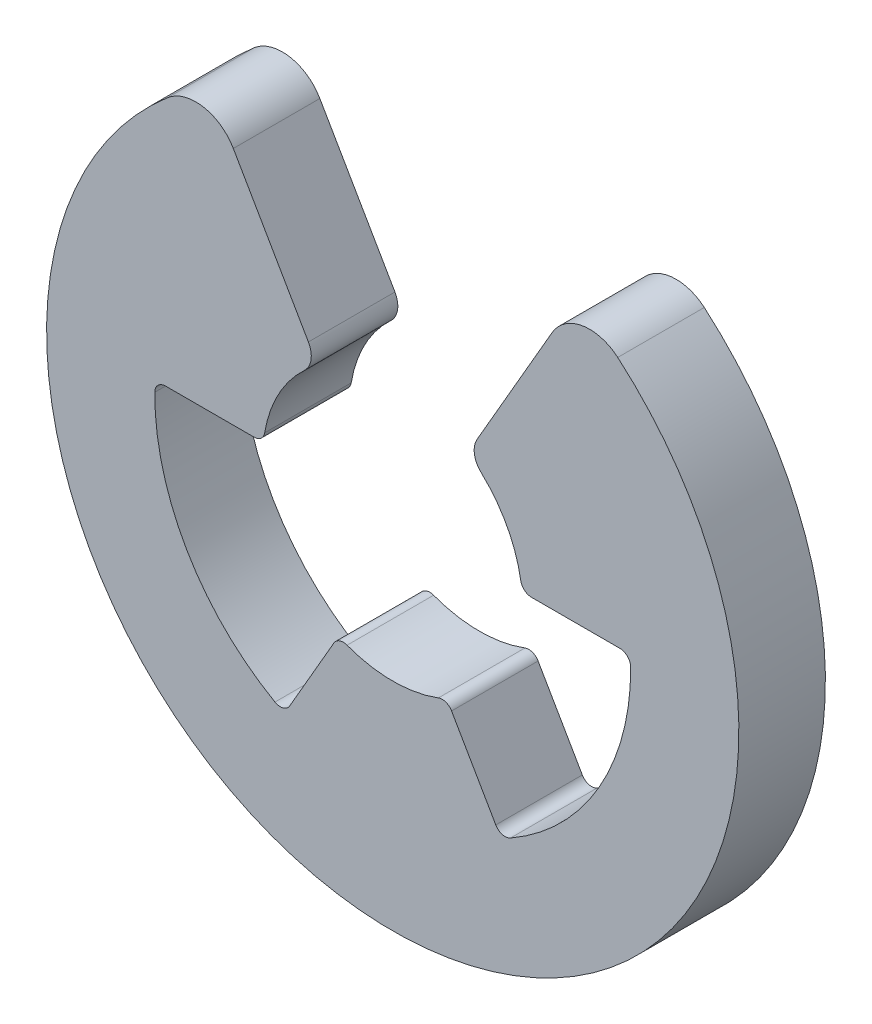
ISO-10303-21;
HEADER;
FILE_DESCRIPTION(('STEP AP214'),'2;1');
FILE_NAME('part.step','',(''),(''),'','','');
FILE_SCHEMA(('AUTOMOTIVE_DESIGN { 1 0 10303 214 1 1 1 1 }'));
ENDSEC;
DATA;
#1=APPLICATION_CONTEXT('core data for automotive mechanical design processes');
#2=APPLICATION_PROTOCOL_DEFINITION('international standard','automotive_design',2000,#1);
#3=PRODUCT_CONTEXT('',#1,'mechanical');
#4=PRODUCT('Part','Part','',(#3));
#5=PRODUCT_RELATED_PRODUCT_CATEGORY('part','',(#4));
#6=PRODUCT_DEFINITION_FORMATION('','',#4);
#7=PRODUCT_DEFINITION_CONTEXT('part definition',#1,'design');
#8=PRODUCT_DEFINITION('design','',#6,#7);
#9=PRODUCT_DEFINITION_SHAPE('','',#8);
#10=(LENGTH_UNIT() NAMED_UNIT(*) SI_UNIT(.MILLI.,.METRE.));
#11=(NAMED_UNIT(*) PLANE_ANGLE_UNIT() SI_UNIT($,.RADIAN.));
#12=(NAMED_UNIT(*) SI_UNIT($,.STERADIAN.) SOLID_ANGLE_UNIT());
#13=UNCERTAINTY_MEASURE_WITH_UNIT(LENGTH_MEASURE(1.E-05),#10,'distance_accuracy_value','');
#14=(GEOMETRIC_REPRESENTATION_CONTEXT(3) GLOBAL_UNCERTAINTY_ASSIGNED_CONTEXT((#13)) GLOBAL_UNIT_ASSIGNED_CONTEXT((#10,
#11,#12)) REPRESENTATION_CONTEXT('',''));
#15=CARTESIAN_POINT('',(0.,0.,0.));
#16=DIRECTION('',(0.,0.,1.));
#17=DIRECTION('',(1.,0.,0.));
#18=AXIS2_PLACEMENT_3D('',#15,#16,#17);
#19=CARTESIAN_POINT('',(5.24990813697038,0.0310572595990377,1.99999999999972));
#20=DIRECTION('',(0.,0.,-1.));
#21=DIRECTION('',(-0.999999999999996,0.,0.));
#22=AXIS2_PLACEMENT_3D('',#19,#20,#21);
#23=CYLINDRICAL_SURFACE('',#22,0.250000000000024);
#24=CARTESIAN_POINT('',(5.24990813697043,0.0310572595989822,-2.77555756156289E-13));
#25=DIRECTION('',(0.,0.,-1.));
#26=DIRECTION('',(0.999999999999996,0.,0.));
#27=AXIS2_PLACEMENT_3D('',#24,#25,#26);
#28=CIRCLE('',#27,0.250000000000024);
#29=CARTESIAN_POINT('',(5.24990813697015,0.281057259598816,-2.77555756156289E-13));
#30=VERTEX_POINT('',#29);
#31=CARTESIAN_POINT('',(5.49990376254042,0.0325361767225529,-2.77555756156289E-13));
#32=VERTEX_POINT('',#31);
#33=EDGE_CURVE('E256',#30,#32,#28,.T.);
#34=ORIENTED_EDGE('',*,*,#33,.T.);
#35=DIRECTION('',(0.,0.,-1.));
#36=VECTOR('',#35,1.);
#37=CARTESIAN_POINT('',(5.49990376254017,0.032536176722775,1.99999999999972));
#38=LINE('',#37,#36);
#39=CARTESIAN_POINT('',(5.49990376254017,0.032536176722775,1.99999999999972));
#40=VERTEX_POINT('',#39);
#41=EDGE_CURVE('E13',#40,#32,#38,.T.);
#42=ORIENTED_EDGE('',*,*,#41,.F.);
#43=CARTESIAN_POINT('',(5.24990813697038,0.0310572595990377,1.99999999999972));
#44=DIRECTION('',(0.,0.,-1.));
#45=DIRECTION('',(0.999999999999996,0.,0.));
#46=AXIS2_PLACEMENT_3D('',#43,#44,#45);
#47=CIRCLE('',#46,0.250000000000024);
#48=CARTESIAN_POINT('',(5.24990813697021,0.281057259598788,1.99999999999972));
#49=VERTEX_POINT('',#48);
#50=EDGE_CURVE('E328',#49,#40,#47,.T.);
#51=ORIENTED_EDGE('',*,*,#50,.F.);
#52=DIRECTION('',(0.,0.,-1.));
#53=VECTOR('',#52,1.);
#54=CARTESIAN_POINT('',(5.24990813697021,0.281057259598788,1.99999999999972));
#55=LINE('',#54,#53);
#56=EDGE_CURVE('E252',#49,#30,#55,.T.);
#57=ORIENTED_EDGE('',*,*,#56,.T.);
#58=EDGE_LOOP('',(#34,#42,#51,#57));
#59=FACE_BOUND('',#58,.T.);
#60=ADVANCED_FACE('F58',(#59),#23,.F.);
#61=CARTESIAN_POINT('',(0.,0.,2.));
#62=DIRECTION('',(0.,0.,-1.));
#63=DIRECTION('',(-0.999999999999996,0.,0.));
#64=AXIS2_PLACEMENT_3D('',#61,#62,#63);
#65=CYLINDRICAL_SURFACE('',#64,5.5);
#66=CARTESIAN_POINT('',(0.,0.,0.));
#67=DIRECTION('',(0.,0.,-1.));
#68=DIRECTION('',(0.999999999999996,0.,0.));
#69=AXIS2_PLACEMENT_3D('',#66,#67,#68);
#70=CIRCLE('',#69,5.5);
#71=CARTESIAN_POINT('',(2.72177472568619,-4.77932446509083,0.));
#72=VERTEX_POINT('',#71);
#73=EDGE_CURVE('E260',#32,#72,#70,.T.);
#74=ORIENTED_EDGE('',*,*,#73,.T.);
#75=DIRECTION('',(0.,0.,-1.));
#76=VECTOR('',#75,1.);
#77=CARTESIAN_POINT('',(2.72177472568624,-4.77932446509077,2.00000000000006));
#78=LINE('',#77,#76);
#79=CARTESIAN_POINT('',(2.72177472568624,-4.77932446509077,2.00000000000006));
#80=VERTEX_POINT('',#79);
#81=EDGE_CURVE('E67',#80,#72,#78,.T.);
#82=ORIENTED_EDGE('',*,*,#81,.F.);
#83=CARTESIAN_POINT('',(0.,0.,2.));
#84=DIRECTION('',(0.,0.,-1.));
#85=DIRECTION('',(0.999999999999996,0.,0.));
#86=AXIS2_PLACEMENT_3D('',#83,#84,#85);
#87=CIRCLE('',#86,5.5);
#88=EDGE_CURVE('E166',#40,#80,#87,.T.);
#89=ORIENTED_EDGE('',*,*,#88,.F.);
#90=ORIENTED_EDGE('',*,*,#41,.T.);
#91=EDGE_LOOP('',(#74,#82,#89,#90));
#92=FACE_BOUND('',#91,.T.);
#93=ADVANCED_FACE('F524',(#92),#65,.F.);
#94=CARTESIAN_POINT('',(2.59805769270058,-4.56208244395034,1.99999999999995));
#95=DIRECTION('',(0.,0.,-1.));
#96=DIRECTION('',(-0.999999999999996,0.,0.));
#97=AXIS2_PLACEMENT_3D('',#94,#95,#96);
#98=CYLINDRICAL_SURFACE('',#97,0.25);
#99=CARTESIAN_POINT('',(2.59805769270077,-4.56208244395037,0.));
#100=DIRECTION('',(0.,0.,-1.));
#101=DIRECTION('',(-0.999999999999996,0.,0.));
#102=AXIS2_PLACEMENT_3D('',#99,#100,#101);
#103=CIRCLE('',#102,0.25);
#104=CARTESIAN_POINT('',(2.38155134175455,-4.68708244395041,0.));
#105=VERTEX_POINT('',#104);
#106=EDGE_CURVE('E263',#72,#105,#103,.T.);
#107=ORIENTED_EDGE('',*,*,#106,.T.);
#108=DIRECTION('',(0.,0.,-1.));
#109=VECTOR('',#108,1.);
#110=CARTESIAN_POINT('',(2.38155134175444,-4.68708244395033,1.99999999999995));
#111=LINE('',#110,#109);
#112=CARTESIAN_POINT('',(2.38155134175444,-4.68708244395033,1.99999999999995));
#113=VERTEX_POINT('',#112);
#114=EDGE_CURVE('E403',#113,#105,#111,.T.);
#115=ORIENTED_EDGE('',*,*,#114,.F.);
#116=CARTESIAN_POINT('',(2.59805769270058,-4.56208244395034,1.99999999999995));
#117=DIRECTION('',(0.,0.,-1.));
#118=DIRECTION('',(-0.999999999999996,0.,0.));
#119=AXIS2_PLACEMENT_3D('',#116,#117,#118);
#120=CIRCLE('',#119,0.25);
#121=EDGE_CURVE('E414',#80,#113,#120,.T.);
#122=ORIENTED_EDGE('',*,*,#121,.F.);
#123=ORIENTED_EDGE('',*,*,#81,.T.);
#124=EDGE_LOOP('',(#107,#115,#122,#123));
#125=FACE_BOUND('',#124,.T.);
#126=ADVANCED_FACE('F412',(#125),#98,.F.);
#127=CARTESIAN_POINT('',(2.38155134175444,-4.68708244395033,1.99999999999995));
#128=DIRECTION('',(-0.86602540378444,-0.499999999999998,0.));
#129=DIRECTION('',(0.499999999999991,-0.866025403784441,0.));
#130=AXIS2_PLACEMENT_3D('',#127,#128,#129);
#131=PLANE('',#130);
#132=DIRECTION('',(-0.499999999999991,0.866025403784441,0.));
#133=VECTOR('',#132,1.);
#134=CARTESIAN_POINT('',(2.38155134175455,-4.68708244395041,0.));
#135=LINE('',#134,#133);
#136=CARTESIAN_POINT('',(1.35975651263315,-2.91728188500065,1.66533453693773E-13));
#137=VERTEX_POINT('',#136);
#138=EDGE_CURVE('E266',#105,#137,#135,.T.);
#139=ORIENTED_EDGE('',*,*,#138,.T.);
#140=DIRECTION('',(0.,0.,-1.));
#141=VECTOR('',#140,1.);
#142=CARTESIAN_POINT('',(1.35975651263295,-2.91728188500068,2.00000000000017));
#143=LINE('',#142,#141);
#144=CARTESIAN_POINT('',(1.35975651263295,-2.91728188500068,2.00000000000017));
#145=VERTEX_POINT('',#144);
#146=EDGE_CURVE('E399',#145,#137,#143,.T.);
#147=ORIENTED_EDGE('',*,*,#146,.F.);
#148=DIRECTION('',(-0.499999999999991,0.866025403784441,0.));
#149=VECTOR('',#148,1.);
#150=CARTESIAN_POINT('',(2.38155134175444,-4.68708244395033,1.99999999999995));
#151=LINE('',#150,#149);
#152=EDGE_CURVE('E433',#113,#145,#151,.T.);
#153=ORIENTED_EDGE('',*,*,#152,.F.);
#154=ORIENTED_EDGE('',*,*,#114,.T.);
#155=EDGE_LOOP('',(#139,#147,#153,#154));
#156=FACE_BOUND('',#155,.T.);
#157=ADVANCED_FACE('F423',(#156),#131,.F.);
#158=CARTESIAN_POINT('',(1.14325016168668,-3.04228188500069,2.00000000000017));
#159=DIRECTION('',(0.,0.,-1.));
#160=DIRECTION('',(-0.999999999999996,0.,0.));
#161=AXIS2_PLACEMENT_3D('',#158,#159,#160);
#162=CYLINDRICAL_SURFACE('',#161,0.25);
#163=CARTESIAN_POINT('',(1.14325016168704,-3.04228188500072,1.66533453693773E-13));
#164=DIRECTION('',(0.,0.,1.));
#165=DIRECTION('',(0.999999999999996,0.,0.));
#166=AXIS2_PLACEMENT_3D('',#163,#164,#165);
#167=CIRCLE('',#166,0.25);
#168=CARTESIAN_POINT('',(1.05530784155727,-2.80826020153915,1.66533453693773E-13));
#169=VERTEX_POINT('',#168);
#170=EDGE_CURVE('E269',#137,#169,#167,.T.);
#171=ORIENTED_EDGE('',*,*,#170,.T.);
#172=DIRECTION('',(0.,0.,-1.));
#173=VECTOR('',#172,1.);
#174=CARTESIAN_POINT('',(1.05530784155702,-2.80826020153896,2.00000000000017));
#175=LINE('',#174,#173);
#176=CARTESIAN_POINT('',(1.05530784155702,-2.80826020153896,2.00000000000017));
#177=VERTEX_POINT('',#176);
#178=EDGE_CURVE('E395',#177,#169,#175,.T.);
#179=ORIENTED_EDGE('',*,*,#178,.F.);
#180=CARTESIAN_POINT('',(1.14325016168668,-3.04228188500069,2.00000000000017));
#181=DIRECTION('',(0.,0.,1.));
#182=DIRECTION('',(0.999999999999996,0.,0.));
#183=AXIS2_PLACEMENT_3D('',#180,#181,#182);
#184=CIRCLE('',#183,0.25);
#185=EDGE_CURVE('E429',#145,#177,#184,.T.);
#186=ORIENTED_EDGE('',*,*,#185,.F.);
#187=ORIENTED_EDGE('',*,*,#146,.T.);
#188=EDGE_LOOP('',(#171,#179,#186,#187));
#189=FACE_BOUND('',#188,.T.);
#190=ADVANCED_FACE('F427',(#189),#162,.T.);
#191=CARTESIAN_POINT('',(0.,0.,2.));
#192=DIRECTION('',(0.,0.,-1.));
#193=DIRECTION('',(-0.999999999999996,0.,0.));
#194=AXIS2_PLACEMENT_3D('',#191,#192,#193);
#195=CYLINDRICAL_SURFACE('',#194,3.);
#196=CARTESIAN_POINT('',(0.,0.,0.));
#197=DIRECTION('',(0.,0.,-1.));
#198=DIRECTION('',(0.999999999999996,0.,0.));
#199=AXIS2_PLACEMENT_3D('',#196,#197,#198);
#200=CIRCLE('',#199,3.);
#201=CARTESIAN_POINT('',(-1.05530784155694,-2.80826020153918,0.));
#202=VERTEX_POINT('',#201);
#203=EDGE_CURVE('E272',#169,#202,#200,.T.);
#204=ORIENTED_EDGE('',*,*,#203,.T.);
#205=DIRECTION('',(0.,0.,-1.));
#206=VECTOR('',#205,1.);
#207=CARTESIAN_POINT('',(-1.05530784155697,-2.80826020153901,2.00000000000006));
#208=LINE('',#207,#206);
#209=CARTESIAN_POINT('',(-1.05530784155697,-2.80826020153901,2.00000000000006));
#210=VERTEX_POINT('',#209);
#211=EDGE_CURVE('E391',#210,#202,#208,.T.);
#212=ORIENTED_EDGE('',*,*,#211,.F.);
#213=CARTESIAN_POINT('',(0.,0.,2.));
#214=DIRECTION('',(0.,0.,-1.));
#215=DIRECTION('',(0.999999999999996,0.,0.));
#216=AXIS2_PLACEMENT_3D('',#213,#214,#215);
#217=CIRCLE('',#216,3.);
#218=EDGE_CURVE('E432',#177,#210,#217,.T.);
#219=ORIENTED_EDGE('',*,*,#218,.F.);
#220=ORIENTED_EDGE('',*,*,#178,.T.);
#221=EDGE_LOOP('',(#204,#212,#219,#220));
#222=FACE_BOUND('',#221,.T.);
#223=ADVANCED_FACE('F537',(#222),#195,.F.);
#224=CARTESIAN_POINT('',(-1.14325016168684,-3.04228188500089,2.00000000000006));
#225=DIRECTION('',(0.,0.,-1.));
#226=DIRECTION('',(-0.999999999999996,0.,0.));
#227=AXIS2_PLACEMENT_3D('',#224,#225,#226);
#228=CYLINDRICAL_SURFACE('',#227,0.25);
#229=CARTESIAN_POINT('',(-1.14325016168659,-3.04228188500083,0.));
#230=DIRECTION('',(0.,0.,1.));
#231=DIRECTION('',(-0.999999999999996,0.,0.));
#232=AXIS2_PLACEMENT_3D('',#229,#230,#231);
#233=CIRCLE('',#232,0.25);
#234=CARTESIAN_POINT('',(-1.35975651263265,-2.91728188500065,0.));
#235=VERTEX_POINT('',#234);
#236=EDGE_CURVE('E275',#202,#235,#233,.T.);
#237=ORIENTED_EDGE('',*,*,#236,.T.);
#238=DIRECTION('',(0.,0.,-1.));
#239=VECTOR('',#238,1.);
#240=CARTESIAN_POINT('',(-1.35975651263284,-2.91728188500068,2.00000000000006));
#241=LINE('',#240,#239);
#242=CARTESIAN_POINT('',(-1.35975651263284,-2.91728188500068,2.00000000000006));
#243=VERTEX_POINT('',#242);
#244=EDGE_CURVE('E387',#243,#235,#241,.T.);
#245=ORIENTED_EDGE('',*,*,#244,.F.);
#246=CARTESIAN_POINT('',(-1.14325016168684,-3.04228188500089,2.00000000000006));
#247=DIRECTION('',(0.,0.,1.));
#248=DIRECTION('',(-0.999999999999996,0.,0.));
#249=AXIS2_PLACEMENT_3D('',#246,#247,#248);
#250=CIRCLE('',#249,0.25);
#251=EDGE_CURVE('E438',#210,#243,#250,.T.);
#252=ORIENTED_EDGE('',*,*,#251,.F.);
#253=ORIENTED_EDGE('',*,*,#211,.T.);
#254=EDGE_LOOP('',(#237,#245,#252,#253));
#255=FACE_BOUND('',#254,.T.);
#256=ADVANCED_FACE('F540',(#255),#228,.T.);
#257=CARTESIAN_POINT('',(-2.38155134175434,-4.68708244395044,1.99999999999984));
#258=DIRECTION('',(0.866025403784437,-0.499999999999993,0.));
#259=DIRECTION('',(0.499999999999996,0.866025403784444,0.));
#260=AXIS2_PLACEMENT_3D('',#257,#258,#259);
#261=PLANE('',#260);
#262=DIRECTION('',(-0.499999999999996,-0.866025403784444,0.));
#263=VECTOR('',#262,1.);
#264=CARTESIAN_POINT('',(-2.38155134175427,-4.6870824439505,-1.66533453693773E-13));
#265=LINE('',#264,#263);
#266=CARTESIAN_POINT('',(-2.38155134175427,-4.6870824439505,-1.66533453693773E-13));
#267=VERTEX_POINT('',#266);
#268=EDGE_CURVE('E278',#235,#267,#265,.T.);
#269=ORIENTED_EDGE('',*,*,#268,.T.);
#270=DIRECTION('',(0.,0.,-1.));
#271=VECTOR('',#270,1.);
#272=CARTESIAN_POINT('',(-2.38155134175434,-4.68708244395044,1.99999999999984));
#273=LINE('',#272,#271);
#274=CARTESIAN_POINT('',(-2.38155134175434,-4.68708244395044,1.99999999999984));
#275=VERTEX_POINT('',#274);
#276=EDGE_CURVE('E383',#275,#267,#273,.T.);
#277=ORIENTED_EDGE('',*,*,#276,.F.);
#278=DIRECTION('',(-0.499999999999996,-0.866025403784444,0.));
#279=VECTOR('',#278,1.);
#280=CARTESIAN_POINT('',(-2.38155134175434,-4.68708244395044,1.99999999999984));
#281=LINE('',#280,#279);
#282=EDGE_CURVE('E445',#243,#275,#281,.T.);
#283=ORIENTED_EDGE('',*,*,#282,.F.);
#284=ORIENTED_EDGE('',*,*,#244,.T.);
#285=EDGE_LOOP('',(#269,#277,#283,#284));
#286=FACE_BOUND('',#285,.T.);
#287=ADVANCED_FACE('F544',(#286),#261,.F.);
#288=CARTESIAN_POINT('',(-2.59805769270038,-4.56208244395051,2.00000000000006));
#289=DIRECTION('',(0.,0.,-1.));
#290=DIRECTION('',(-0.999999999999996,0.,0.));
#291=AXIS2_PLACEMENT_3D('',#288,#289,#290);
#292=CYLINDRICAL_SURFACE('',#291,0.25);
#293=CARTESIAN_POINT('',(-2.59805769270038,-4.56208244395026,0.));
#294=DIRECTION('',(0.,0.,-1.));
#295=DIRECTION('',(0.999999999999996,0.,0.));
#296=AXIS2_PLACEMENT_3D('',#293,#294,#295);
#297=CIRCLE('',#296,0.25);
#298=CARTESIAN_POINT('',(-2.72177472568619,-4.77932446509091,-1.66533453693773E-13));
#299=VERTEX_POINT('',#298);
#300=EDGE_CURVE('E281',#267,#299,#297,.T.);
#301=ORIENTED_EDGE('',*,*,#300,.T.);
#302=DIRECTION('',(0.,0.,-1.));
#303=VECTOR('',#302,1.);
#304=CARTESIAN_POINT('',(-2.72177472568624,-4.77932446509083,1.99999999999984));
#305=LINE('',#304,#303);
#306=CARTESIAN_POINT('',(-2.72177472568624,-4.77932446509083,1.99999999999984));
#307=VERTEX_POINT('',#306);
#308=EDGE_CURVE('E379',#307,#299,#305,.T.);
#309=ORIENTED_EDGE('',*,*,#308,.F.);
#310=CARTESIAN_POINT('',(-2.59805769270038,-4.56208244395051,2.00000000000006));
#311=DIRECTION('',(0.,0.,-1.));
#312=DIRECTION('',(0.999999999999996,0.,0.));
#313=AXIS2_PLACEMENT_3D('',#310,#311,#312);
#314=CIRCLE('',#313,0.25);
#315=EDGE_CURVE('E448',#275,#307,#314,.T.);
#316=ORIENTED_EDGE('',*,*,#315,.F.);
#317=ORIENTED_EDGE('',*,*,#276,.T.);
#318=EDGE_LOOP('',(#301,#309,#316,#317));
#319=FACE_BOUND('',#318,.T.);
#320=ADVANCED_FACE('F548',(#319),#292,.F.);
#321=CARTESIAN_POINT('',(0.,0.,2.));
#322=DIRECTION('',(0.,0.,-1.));
#323=DIRECTION('',(-0.999999999999996,0.,0.));
#324=AXIS2_PLACEMENT_3D('',#321,#322,#323);
#325=CYLINDRICAL_SURFACE('',#324,5.5);
#326=CARTESIAN_POINT('',(0.,0.,0.));
#327=DIRECTION('',(0.,0.,-1.));
#328=DIRECTION('',(0.999999999999996,0.,0.));
#329=AXIS2_PLACEMENT_3D('',#326,#327,#328);
#330=CIRCLE('',#329,5.5);
#331=CARTESIAN_POINT('',(-5.49990376253995,0.0325361767225807,-1.11022302462516E-13));
#332=VERTEX_POINT('',#331);
#333=EDGE_CURVE('E284',#299,#332,#330,.T.);
#334=ORIENTED_EDGE('',*,*,#333,.T.);
#335=DIRECTION('',(0.,0.,-1.));
#336=VECTOR('',#335,1.);
#337=CARTESIAN_POINT('',(-5.49990376254005,0.0325361767227195,1.99999999999989));
#338=LINE('',#337,#336);
#339=CARTESIAN_POINT('',(-5.49990376254005,0.0325361767227195,1.99999999999989));
#340=VERTEX_POINT('',#339);
#341=EDGE_CURVE('E375',#340,#332,#338,.T.);
#342=ORIENTED_EDGE('',*,*,#341,.F.);
#343=CARTESIAN_POINT('',(0.,0.,2.));
#344=DIRECTION('',(0.,0.,-1.));
#345=DIRECTION('',(0.999999999999996,0.,0.));
#346=AXIS2_PLACEMENT_3D('',#343,#344,#345);
#347=CIRCLE('',#346,5.5);
#348=EDGE_CURVE('E451',#307,#340,#347,.T.);
#349=ORIENTED_EDGE('',*,*,#348,.F.);
#350=ORIENTED_EDGE('',*,*,#308,.T.);
#351=EDGE_LOOP('',(#334,#342,#349,#350));
#352=FACE_BOUND('',#351,.T.);
#353=ADVANCED_FACE('F552',(#352),#325,.F.);
#354=CARTESIAN_POINT('',(-5.24990813697022,0.0310572595989822,1.99999999999989));
#355=DIRECTION('',(0.,0.,-1.));
#356=DIRECTION('',(-0.999999999999996,0.,0.));
#357=AXIS2_PLACEMENT_3D('',#354,#355,#356);
#358=CYLINDRICAL_SURFACE('',#357,0.249999999999986);
#359=CARTESIAN_POINT('',(-5.24990813697031,0.0310572595988712,-1.11022302462516E-13));
#360=DIRECTION('',(0.,0.,-1.));
#361=DIRECTION('',(-0.999999999999996,0.,0.));
#362=AXIS2_PLACEMENT_3D('',#359,#360,#361);
#363=CIRCLE('',#362,0.249999999999986);
#364=CARTESIAN_POINT('',(-5.24990813697013,0.281057259598844,-2.22044604925031E-13));
#365=VERTEX_POINT('',#364);
#366=EDGE_CURVE('E287',#332,#365,#363,.T.);
#367=ORIENTED_EDGE('',*,*,#366,.T.);
#368=DIRECTION('',(0.,0.,-1.));
#369=VECTOR('',#368,1.);
#370=CARTESIAN_POINT('',(-5.24990813697018,0.281057259598733,1.99999999999978));
#371=LINE('',#370,#369);
#372=CARTESIAN_POINT('',(-5.24990813697018,0.281057259598733,1.99999999999978));
#373=VERTEX_POINT('',#372);
#374=EDGE_CURVE('E371',#373,#365,#371,.T.);
#375=ORIENTED_EDGE('',*,*,#374,.F.);
#376=CARTESIAN_POINT('',(-5.24990813697022,0.0310572595989822,1.99999999999989));
#377=DIRECTION('',(0.,0.,-1.));
#378=DIRECTION('',(-0.999999999999996,0.,0.));
#379=AXIS2_PLACEMENT_3D('',#376,#377,#378);
#380=CIRCLE('',#379,0.249999999999986);
#381=EDGE_CURVE('E454',#340,#373,#380,.T.);
#382=ORIENTED_EDGE('',*,*,#381,.F.);
#383=ORIENTED_EDGE('',*,*,#341,.T.);
#384=EDGE_LOOP('',(#367,#375,#382,#383));
#385=FACE_BOUND('',#384,.T.);
#386=ADVANCED_FACE('F556',(#385),#358,.F.);
#387=CARTESIAN_POINT('',(-5.24990813697018,0.281057259598733,1.99999999999978));
#388=DIRECTION('',(0.,1.,0.));
#389=DIRECTION('',(-0.999999999999996,0.,0.));
#390=AXIS2_PLACEMENT_3D('',#387,#388,#389);
#391=PLANE('',#390);
#392=DIRECTION('',(0.999999999999996,0.,0.));
#393=VECTOR('',#392,1.);
#394=CARTESIAN_POINT('',(-5.24990813697013,0.281057259598844,-2.22044604925031E-13));
#395=LINE('',#394,#393);
#396=CARTESIAN_POINT('',(-3.2063184787271,0.281057259598677,-1.66533453693773E-13));
#397=VERTEX_POINT('',#396);
#398=EDGE_CURVE('E290',#365,#397,#395,.T.);
#399=ORIENTED_EDGE('',*,*,#398,.T.);
#400=DIRECTION('',(0.,0.,-1.));
#401=VECTOR('',#400,1.);
#402=CARTESIAN_POINT('',(-3.20631847872703,0.281057259598844,1.99999999999984));
#403=LINE('',#402,#401);
#404=CARTESIAN_POINT('',(-3.20631847872703,0.281057259598844,1.99999999999984));
#405=VERTEX_POINT('',#404);
#406=EDGE_CURVE('E367',#405,#397,#403,.T.);
#407=ORIENTED_EDGE('',*,*,#406,.F.);
#408=DIRECTION('',(0.999999999999996,0.,0.));
#409=VECTOR('',#408,1.);
#410=CARTESIAN_POINT('',(-5.24990813697018,0.281057259598733,1.99999999999978));
#411=LINE('',#410,#409);
#412=EDGE_CURVE('E457',#373,#405,#411,.T.);
#413=ORIENTED_EDGE('',*,*,#412,.F.);
#414=ORIENTED_EDGE('',*,*,#374,.T.);
#415=EDGE_LOOP('',(#399,#407,#413,#414));
#416=FACE_BOUND('',#415,.T.);
#417=ADVANCED_FACE('F560',(#416),#391,.F.);
#418=CARTESIAN_POINT('',(-3.20631847872722,0.531057259598816,1.99999999999984));
#419=DIRECTION('',(0.,0.,-1.));
#420=DIRECTION('',(-0.999999999999996,0.,0.));
#421=AXIS2_PLACEMENT_3D('',#418,#419,#420);
#422=CYLINDRICAL_SURFACE('',#421,0.25);
#423=CARTESIAN_POINT('',(-3.206318478727,0.531057259598872,-1.66533453693773E-13));
#424=DIRECTION('',(0.,0.,1.));
#425=DIRECTION('',(0.999999999999996,0.,0.));
#426=AXIS2_PLACEMENT_3D('',#423,#424,#425);
#427=CIRCLE('',#426,0.25);
#428=CARTESIAN_POINT('',(-2.95967859574793,0.490206701168033,-1.66533453693773E-13));
#429=VERTEX_POINT('',#428);
#430=EDGE_CURVE('E293',#397,#429,#427,.T.);
#431=ORIENTED_EDGE('',*,*,#430,.T.);
#432=DIRECTION('',(0.,0.,-1.));
#433=VECTOR('',#432,1.);
#434=CARTESIAN_POINT('',(-2.95967859574807,0.490206701168117,1.99999999999984));
#435=LINE('',#434,#433);
#436=CARTESIAN_POINT('',(-2.95967859574807,0.490206701168117,1.99999999999984));
#437=VERTEX_POINT('',#436);
#438=EDGE_CURVE('E363',#437,#429,#435,.T.);
#439=ORIENTED_EDGE('',*,*,#438,.F.);
#440=CARTESIAN_POINT('',(-3.20631847872722,0.531057259598816,1.99999999999984));
#441=DIRECTION('',(0.,0.,1.));
#442=DIRECTION('',(0.999999999999996,0.,0.));
#443=AXIS2_PLACEMENT_3D('',#440,#441,#442);
#444=CIRCLE('',#443,0.25);
#445=EDGE_CURVE('E460',#405,#437,#444,.T.);
#446=ORIENTED_EDGE('',*,*,#445,.F.);
#447=ORIENTED_EDGE('',*,*,#406,.T.);
#448=EDGE_LOOP('',(#431,#439,#446,#447));
#449=FACE_BOUND('',#448,.T.);
#450=ADVANCED_FACE('F564',(#449),#422,.T.);
#451=CARTESIAN_POINT('',(0.,0.,2.));
#452=DIRECTION('',(0.,0.,-1.));
#453=DIRECTION('',(-0.999999999999996,0.,0.));
#454=AXIS2_PLACEMENT_3D('',#451,#452,#453);
#455=CYLINDRICAL_SURFACE('',#454,3.);
#456=CARTESIAN_POINT('',(0.,0.,0.));
#457=DIRECTION('',(0.,0.,-1.));
#458=DIRECTION('',(0.999999999999996,0.,0.));
#459=AXIS2_PLACEMENT_3D('',#456,#457,#458);
#460=CIRCLE('',#459,3.);
#461=CARTESIAN_POINT('',(-2.04195766567072,2.19781912167666,-1.11022302462516E-13));
#462=VERTEX_POINT('',#461);
#463=EDGE_CURVE('E296',#429,#462,#460,.T.);
#464=ORIENTED_EDGE('',*,*,#463,.T.);
#465=DIRECTION('',(0.,0.,-1.));
#466=VECTOR('',#465,1.);
#467=CARTESIAN_POINT('',(-2.0419576656706,2.19781912167674,1.99999999999989));
#468=LINE('',#467,#466);
#469=CARTESIAN_POINT('',(-2.0419576656706,2.19781912167674,1.99999999999989));
#470=VERTEX_POINT('',#469);
#471=EDGE_CURVE('E359',#470,#462,#468,.T.);
#472=ORIENTED_EDGE('',*,*,#471,.F.);
#473=CARTESIAN_POINT('',(0.,0.,2.));
#474=DIRECTION('',(0.,0.,-1.));
#475=DIRECTION('',(0.999999999999996,0.,0.));
#476=AXIS2_PLACEMENT_3D('',#473,#474,#475);
#477=CIRCLE('',#476,3.);
#478=EDGE_CURVE('E463',#437,#470,#477,.T.);
#479=ORIENTED_EDGE('',*,*,#478,.F.);
#480=ORIENTED_EDGE('',*,*,#438,.T.);
#481=EDGE_LOOP('',(#464,#472,#479,#480));
#482=FACE_BOUND('',#481,.T.);
#483=ADVANCED_FACE('F568',(#482),#455,.F.);
#484=CARTESIAN_POINT('',(-2.38228394328231,2.56412230862293,1.99999999999989));
#485=DIRECTION('',(0.,0.,-1.));
#486=DIRECTION('',(-0.999999999999996,0.,0.));
#487=AXIS2_PLACEMENT_3D('',#484,#485,#486);
#488=CYLINDRICAL_SURFACE('',#487,0.5);
#489=CARTESIAN_POINT('',(-2.38228394328222,2.56412230862296,-1.11022302462516E-13));
#490=DIRECTION('',(0.,0.,1.));
#491=DIRECTION('',(-0.999999999999996,0.,0.));
#492=AXIS2_PLACEMENT_3D('',#489,#490,#491);
#493=CIRCLE('',#492,0.5);
#494=CARTESIAN_POINT('',(-1.94927124139038,2.8141223086228,-1.11022302462516E-13));
#495=VERTEX_POINT('',#494);
#496=EDGE_CURVE('E299',#462,#495,#493,.T.);
#497=ORIENTED_EDGE('',*,*,#496,.T.);
#498=DIRECTION('',(0.,0.,-1.));
#499=VECTOR('',#498,1.);
#500=CARTESIAN_POINT('',(-1.94927124139034,2.81412230862307,1.99999999999989));
#501=LINE('',#500,#499);
#502=CARTESIAN_POINT('',(-1.94927124139034,2.81412230862307,1.99999999999989));
#503=VERTEX_POINT('',#502);
#504=EDGE_CURVE('E355',#503,#495,#501,.T.);
#505=ORIENTED_EDGE('',*,*,#504,.F.);
#506=CARTESIAN_POINT('',(-2.38228394328231,2.56412230862293,1.99999999999989));
#507=DIRECTION('',(0.,0.,1.));
#508=DIRECTION('',(-0.999999999999996,0.,0.));
#509=AXIS2_PLACEMENT_3D('',#506,#507,#508);
#510=CIRCLE('',#509,0.5);
#511=EDGE_CURVE('E466',#470,#503,#510,.T.);
#512=ORIENTED_EDGE('',*,*,#511,.F.);
#513=ORIENTED_EDGE('',*,*,#471,.T.);
#514=EDGE_LOOP('',(#497,#505,#512,#513));
#515=FACE_BOUND('',#514,.T.);
#516=ADVANCED_FACE('F572',(#515),#488,.T.);
#517=CARTESIAN_POINT('',(-2.98980978035666,4.61638792534622,1.99999999999978));
#518=DIRECTION('',(-0.866025403784435,-0.500000000000008,0.));
#519=DIRECTION('',(0.500000000000001,-0.866025403784435,0.));
#520=AXIS2_PLACEMENT_3D('',#517,#518,#519);
#521=PLANE('',#520);
#522=DIRECTION('',(-0.500000000000001,0.866025403784435,0.));
#523=VECTOR('',#522,1.);
#524=CARTESIAN_POINT('',(-2.98980978035668,4.61638792534613,-2.22044604925031E-13));
#525=LINE('',#524,#523);
#526=CARTESIAN_POINT('',(-3.68429259337932,5.81926744248518,0.));
#527=VERTEX_POINT('',#526);
#528=EDGE_CURVE('E303',#495,#527,#525,.T.);
#529=ORIENTED_EDGE('',*,*,#528,.T.);
#530=DIRECTION('',(0.,0.,-1.));
#531=VECTOR('',#530,1.);
#532=CARTESIAN_POINT('',(-3.68429259337938,5.8192674424854,2.));
#533=LINE('',#532,#531);
#534=CARTESIAN_POINT('',(-3.68429259337938,5.8192674424854,2.));
#535=VERTEX_POINT('',#534);
#536=EDGE_CURVE('E351',#535,#527,#533,.T.);
#537=ORIENTED_EDGE('',*,*,#536,.F.);
#538=DIRECTION('',(-0.500000000000002,0.866025403784435,0.));
#539=VECTOR('',#538,1.);
#540=CARTESIAN_POINT('',(-2.98980978035666,4.61638792534622,1.99999999999978));
#541=LINE('',#540,#539);
#542=EDGE_CURVE('E469',#503,#535,#541,.T.);
#543=ORIENTED_EDGE('',*,*,#542,.F.);
#544=ORIENTED_EDGE('',*,*,#504,.T.);
#545=EDGE_LOOP('',(#529,#537,#543,#544));
#546=FACE_BOUND('',#545,.T.);
#547=ADVANCED_FACE('F576',(#546),#521,.F.);
#548=CARTESIAN_POINT('',(-4.55031799716375,5.31926744248515,2.00000000000011));
#549=DIRECTION('',(0.,0.,-1.));
#550=DIRECTION('',(-0.999999999999996,0.,0.));
#551=AXIS2_PLACEMENT_3D('',#548,#549,#550);
#552=CYLINDRICAL_SURFACE('',#551,1.);
#553=CARTESIAN_POINT('',(-4.55031799716377,5.31926744248518,1.11022302462516E-13));
#554=DIRECTION('',(0.,0.,1.));
#555=DIRECTION('',(0.999999999999996,0.,0.));
#556=AXIS2_PLACEMENT_3D('',#553,#554,#555);
#557=CIRCLE('',#556,1.);
#558=CARTESIAN_POINT('',(-5.20036342533026,6.07916279141155,-1.66533453693773E-13));
#559=VERTEX_POINT('',#558);
#560=EDGE_CURVE('E306',#527,#559,#557,.T.);
#561=ORIENTED_EDGE('',*,*,#560,.T.);
#562=DIRECTION('',(0.,0.,-1.));
#563=VECTOR('',#562,1.);
#564=CARTESIAN_POINT('',(-5.20036342533019,6.07916279141185,1.99999999999984));
#565=LINE('',#564,#563);
#566=CARTESIAN_POINT('',(-5.20036342533019,6.07916279141185,1.99999999999984));
#567=VERTEX_POINT('',#566);
#568=EDGE_CURVE('E347',#567,#559,#565,.T.);
#569=ORIENTED_EDGE('',*,*,#568,.F.);
#570=CARTESIAN_POINT('',(-4.55031799716375,5.31926744248515,2.00000000000011));
#571=DIRECTION('',(0.,0.,1.));
#572=DIRECTION('',(0.999999999999996,0.,0.));
#573=AXIS2_PLACEMENT_3D('',#570,#571,#572);
#574=CIRCLE('',#573,1.);
#575=EDGE_CURVE('E472',#535,#567,#574,.T.);
#576=ORIENTED_EDGE('',*,*,#575,.F.);
#577=ORIENTED_EDGE('',*,*,#536,.T.);
#578=EDGE_LOOP('',(#561,#569,#576,#577));
#579=FACE_BOUND('',#578,.T.);
#580=ADVANCED_FACE('F580',(#579),#552,.T.);
#581=CARTESIAN_POINT('',(0.,0.,2.));
#582=DIRECTION('',(0.,0.,-1.));
#583=DIRECTION('',(-0.999999999999996,0.,0.));
#584=AXIS2_PLACEMENT_3D('',#581,#582,#583);
#585=CYLINDRICAL_SURFACE('',#584,8.);
#586=CARTESIAN_POINT('',(0.,0.,0.));
#587=DIRECTION('',(0.,0.,1.));
#588=DIRECTION('',(0.999999999999996,0.,0.));
#589=AXIS2_PLACEMENT_3D('',#586,#587,#588);
#590=CIRCLE('',#589,8.);
#591=CARTESIAN_POINT('',(5.20036342533051,6.07916279141168,3.33066907387547E-13));
#592=VERTEX_POINT('',#591);
#593=EDGE_CURVE('E309',#559,#592,#590,.T.);
#594=ORIENTED_EDGE('',*,*,#593,.T.);
#595=DIRECTION('',(0.,0.,-1.));
#596=VECTOR('',#595,1.);
#597=CARTESIAN_POINT('',(5.20036342533059,6.0791627914118,2.00000000000033));
#598=LINE('',#597,#596);
#599=CARTESIAN_POINT('',(5.20036342533059,6.0791627914118,2.00000000000033));
#600=VERTEX_POINT('',#599);
#601=EDGE_CURVE('E343',#600,#592,#598,.T.);
#602=ORIENTED_EDGE('',*,*,#601,.F.);
#603=CARTESIAN_POINT('',(0.,0.,2.));
#604=DIRECTION('',(0.,0.,1.));
#605=DIRECTION('',(0.999999999999996,0.,0.));
#606=AXIS2_PLACEMENT_3D('',#603,#604,#605);
#607=CIRCLE('',#606,8.);
#608=EDGE_CURVE('E475',#567,#600,#607,.T.);
#609=ORIENTED_EDGE('',*,*,#608,.F.);
#610=ORIENTED_EDGE('',*,*,#568,.T.);
#611=EDGE_LOOP('',(#594,#602,#609,#610));
#612=FACE_BOUND('',#611,.T.);
#613=ADVANCED_FACE('F584',(#612),#585,.T.);
#614=CARTESIAN_POINT('',(4.55031799716421,5.31926744248545,2.00000000000033));
#615=DIRECTION('',(0.,0.,-1.));
#616=DIRECTION('',(-0.999999999999996,0.,0.));
#617=AXIS2_PLACEMENT_3D('',#614,#615,#616);
#618=CYLINDRICAL_SURFACE('',#617,1.);
#619=CARTESIAN_POINT('',(4.55031799716432,5.31926744248532,3.33066907387547E-13));
#620=DIRECTION('',(0.,0.,1.));
#621=DIRECTION('',(0.999999999999996,0.,0.));
#622=AXIS2_PLACEMENT_3D('',#619,#620,#621);
#623=CIRCLE('',#622,1.);
#624=CARTESIAN_POINT('',(3.68429259337991,5.8192674424854,0.));
#625=VERTEX_POINT('',#624);
#626=EDGE_CURVE('E312',#592,#625,#623,.T.);
#627=ORIENTED_EDGE('',*,*,#626,.T.);
#628=DIRECTION('',(0.,0.,-1.));
#629=VECTOR('',#628,1.);
#630=CARTESIAN_POINT('',(3.68429259337988,5.81926744248532,2.00000000000006));
#631=LINE('',#630,#629);
#632=CARTESIAN_POINT('',(3.68429259337988,5.81926744248532,2.00000000000006));
#633=VERTEX_POINT('',#632);
#634=EDGE_CURVE('E339',#633,#625,#631,.T.);
#635=ORIENTED_EDGE('',*,*,#634,.F.);
#636=CARTESIAN_POINT('',(4.55031799716421,5.31926744248545,2.00000000000033));
#637=DIRECTION('',(0.,0.,1.));
#638=DIRECTION('',(0.999999999999996,0.,0.));
#639=AXIS2_PLACEMENT_3D('',#636,#637,#638);
#640=CIRCLE('',#639,1.);
#641=EDGE_CURVE('E478',#600,#633,#640,.T.);
#642=ORIENTED_EDGE('',*,*,#641,.F.);
#643=ORIENTED_EDGE('',*,*,#601,.T.);
#644=EDGE_LOOP('',(#627,#635,#642,#643));
#645=FACE_BOUND('',#644,.T.);
#646=ADVANCED_FACE('F588',(#645),#618,.T.);
#647=CARTESIAN_POINT('',(2.98980978035673,4.61638792534622,1.99999999999989));
#648=DIRECTION('',(0.866025403784431,-0.500000000000002,0.));
#649=DIRECTION('',(0.500000000000005,0.866025403784438,0.));
#650=AXIS2_PLACEMENT_3D('',#647,#648,#649);
#651=PLANE('',#650);
#652=DIRECTION('',(-0.500000000000005,-0.866025403784438,0.));
#653=VECTOR('',#652,1.);
#654=CARTESIAN_POINT('',(2.98980978035679,4.61638792534611,-1.11022302462516E-13));
#655=LINE('',#654,#653);
#656=CARTESIAN_POINT('',(1.9492712413906,2.81412230862296,0.));
#657=VERTEX_POINT('',#656);
#658=EDGE_CURVE('E316',#625,#657,#655,.T.);
#659=ORIENTED_EDGE('',*,*,#658,.T.);
#660=DIRECTION('',(0.,0.,-1.));
#661=VECTOR('',#660,1.);
#662=CARTESIAN_POINT('',(1.94927124139041,2.81412230862305,2.));
#663=LINE('',#662,#661);
#664=CARTESIAN_POINT('',(1.94927124139041,2.81412230862305,2.));
#665=VERTEX_POINT('',#664);
#666=EDGE_CURVE('E335',#665,#657,#663,.T.);
#667=ORIENTED_EDGE('',*,*,#666,.F.);
#668=DIRECTION('',(-0.500000000000005,-0.866025403784438,0.));
#669=VECTOR('',#668,1.);
#670=CARTESIAN_POINT('',(2.98980978035673,4.61638792534622,1.99999999999989));
#671=LINE('',#670,#669);
#672=EDGE_CURVE('E481',#633,#665,#671,.T.);
#673=ORIENTED_EDGE('',*,*,#672,.F.);
#674=ORIENTED_EDGE('',*,*,#634,.T.);
#675=EDGE_LOOP('',(#659,#667,#673,#674));
#676=FACE_BOUND('',#675,.T.);
#677=ADVANCED_FACE('F506',(#676),#651,.F.);
#678=CARTESIAN_POINT('',(2.38228394328266,2.56412230862302,2.));
#679=DIRECTION('',(0.,0.,-1.));
#680=DIRECTION('',(-0.999999999999996,0.,0.));
#681=AXIS2_PLACEMENT_3D('',#678,#679,#680);
#682=CYLINDRICAL_SURFACE('',#681,0.5);
#683=CARTESIAN_POINT('',(2.38228394328271,2.56412230862285,0.));
#684=DIRECTION('',(0.,0.,1.));
#685=DIRECTION('',(0.999999999999996,0.,0.));
#686=AXIS2_PLACEMENT_3D('',#683,#684,#685);
#687=CIRCLE('',#686,0.5);
#688=CARTESIAN_POINT('',(2.04195766567081,2.1978191216768,0.));
#689=VERTEX_POINT('',#688);
#690=EDGE_CURVE('E319',#657,#689,#687,.T.);
#691=ORIENTED_EDGE('',*,*,#690,.T.);
#692=DIRECTION('',(0.,0.,-1.));
#693=VECTOR('',#692,1.);
#694=CARTESIAN_POINT('',(2.0419576656707,2.19781912167677,2.));
#695=LINE('',#694,#693);
#696=CARTESIAN_POINT('',(2.0419576656707,2.19781912167677,2.));
#697=VERTEX_POINT('',#696);
#698=EDGE_CURVE('E244',#697,#689,#695,.T.);
#699=ORIENTED_EDGE('',*,*,#698,.F.);
#700=CARTESIAN_POINT('',(2.38228394328266,2.56412230862302,2.));
#701=DIRECTION('',(0.,0.,1.));
#702=DIRECTION('',(0.999999999999996,0.,0.));
#703=AXIS2_PLACEMENT_3D('',#700,#701,#702);
#704=CIRCLE('',#703,0.5);
#705=EDGE_CURVE('E233',#665,#697,#704,.T.);
#706=ORIENTED_EDGE('',*,*,#705,.F.);
#707=ORIENTED_EDGE('',*,*,#666,.T.);
#708=EDGE_LOOP('',(#691,#699,#706,#707));
#709=FACE_BOUND('',#708,.T.);
#710=ADVANCED_FACE('F509',(#709),#682,.T.);
#711=CARTESIAN_POINT('',(0.,0.,2.));
#712=DIRECTION('',(0.,0.,-1.));
#713=DIRECTION('',(-0.999999999999996,0.,0.));
#714=AXIS2_PLACEMENT_3D('',#711,#712,#713);
#715=CYLINDRICAL_SURFACE('',#714,3.);
#716=CARTESIAN_POINT('',(0.,0.,0.));
#717=DIRECTION('',(0.,0.,-1.));
#718=DIRECTION('',(0.999999999999996,0.,0.));
#719=AXIS2_PLACEMENT_3D('',#716,#717,#718);
#720=CIRCLE('',#719,3.);
#721=CARTESIAN_POINT('',(2.95967859574831,0.490206701168117,0.));
#722=VERTEX_POINT('',#721);
#723=EDGE_CURVE('E242',#689,#722,#720,.T.);
#724=ORIENTED_EDGE('',*,*,#723,.T.);
#725=DIRECTION('',(0.,0.,-1.));
#726=VECTOR('',#725,1.);
#727=CARTESIAN_POINT('',(2.95967859574817,0.4902067011682,1.99999999999995));
#728=LINE('',#727,#726);
#729=CARTESIAN_POINT('',(2.95967859574817,0.4902067011682,1.99999999999995));
#730=VERTEX_POINT('',#729);
#731=EDGE_CURVE('E239',#730,#722,#728,.T.);
#732=ORIENTED_EDGE('',*,*,#731,.F.);
#733=CARTESIAN_POINT('',(0.,0.,2.));
#734=DIRECTION('',(0.,0.,-1.));
#735=DIRECTION('',(0.999999999999996,0.,0.));
#736=AXIS2_PLACEMENT_3D('',#733,#734,#735);
#737=CIRCLE('',#736,3.);
#738=EDGE_CURVE('E227',#697,#730,#737,.T.);
#739=ORIENTED_EDGE('',*,*,#738,.F.);
#740=ORIENTED_EDGE('',*,*,#698,.T.);
#741=EDGE_LOOP('',(#724,#732,#739,#740));
#742=FACE_BOUND('',#741,.T.);
#743=ADVANCED_FACE('F240',(#742),#715,.F.);
#744=CARTESIAN_POINT('',(3.2063184787271,0.531057259598872,1.99999999999995));
#745=DIRECTION('',(0.,0.,-1.));
#746=DIRECTION('',(-0.999999999999996,0.,0.));
#747=AXIS2_PLACEMENT_3D('',#744,#745,#746);
#748=CYLINDRICAL_SURFACE('',#747,0.25);
#749=CARTESIAN_POINT('',(3.20631847872727,0.531057259598899,0.));
#750=DIRECTION('',(0.,0.,1.));
#751=DIRECTION('',(0.999999999999996,0.,0.));
#752=AXIS2_PLACEMENT_3D('',#749,#750,#751);
#753=CIRCLE('',#752,0.25);
#754=CARTESIAN_POINT('',(3.20631847872715,0.281057259598955,0.));
#755=VERTEX_POINT('',#754);
#756=EDGE_CURVE('E152',#722,#755,#753,.T.);
#757=ORIENTED_EDGE('',*,*,#756,.T.);
#758=DIRECTION('',(0.,0.,-1.));
#759=VECTOR('',#758,1.);
#760=CARTESIAN_POINT('',(3.20631847872732,0.281057259598871,1.99999999999995));
#761=LINE('',#760,#759);
#762=CARTESIAN_POINT('',(3.20631847872732,0.281057259598871,1.99999999999995));
#763=VERTEX_POINT('',#762);
#764=EDGE_CURVE('E245',#763,#755,#761,.T.);
#765=ORIENTED_EDGE('',*,*,#764,.F.);
#766=CARTESIAN_POINT('',(3.2063184787271,0.531057259598872,1.99999999999995));
#767=DIRECTION('',(0.,0.,1.));
#768=DIRECTION('',(0.999999999999996,0.,0.));
#769=AXIS2_PLACEMENT_3D('',#766,#767,#768);
#770=CIRCLE('',#769,0.25);
#771=EDGE_CURVE('E231',#730,#763,#770,.T.);
#772=ORIENTED_EDGE('',*,*,#771,.F.);
#773=ORIENTED_EDGE('',*,*,#731,.T.);
#774=EDGE_LOOP('',(#757,#765,#772,#773));
#775=FACE_BOUND('',#774,.T.);
#776=ADVANCED_FACE('F247',(#775),#748,.T.);
#777=CARTESIAN_POINT('',(5.24990813697021,0.281057259598788,1.99999999999972));
#778=DIRECTION('',(0.,1.,0.));
#779=DIRECTION('',(-0.999999999999997,0.,0.));
#780=AXIS2_PLACEMENT_3D('',#777,#778,#779);
#781=PLANE('',#780);
#782=DIRECTION('',(0.999999999999997,0.,0.));
#783=VECTOR('',#782,1.);
#784=CARTESIAN_POINT('',(5.24990813697015,0.281057259598816,-2.77555756156289E-13));
#785=LINE('',#784,#783);
#786=EDGE_CURVE('E158',#755,#30,#785,.T.);
#787=ORIENTED_EDGE('',*,*,#786,.T.);
#788=ORIENTED_EDGE('',*,*,#56,.F.);
#789=DIRECTION('',(0.999999999999997,0.,0.));
#790=VECTOR('',#789,1.);
#791=CARTESIAN_POINT('',(5.24990813697021,0.281057259598788,1.99999999999972));
#792=LINE('',#791,#790);
#793=EDGE_CURVE('E75',#763,#49,#792,.T.);
#794=ORIENTED_EDGE('',*,*,#793,.F.);
#795=ORIENTED_EDGE('',*,*,#764,.T.);
#796=EDGE_LOOP('',(#787,#788,#794,#795));
#797=FACE_BOUND('',#796,.T.);
#798=ADVANCED_FACE('F513',(#797),#781,.F.);
#799=CARTESIAN_POINT('',(5.24990813697038,0.0310572595990377,1.99999999999972));
#800=DIRECTION('',(0.,0.,1.));
#801=DIRECTION('',(0.999999999999996,0.,0.));
#802=AXIS2_PLACEMENT_3D('',#799,#800,#801);
#803=PLANE('',#802);
#804=ORIENTED_EDGE('',*,*,#50,.T.);
#805=ORIENTED_EDGE('',*,*,#88,.T.);
#806=ORIENTED_EDGE('',*,*,#121,.T.);
#807=ORIENTED_EDGE('',*,*,#152,.T.);
#808=ORIENTED_EDGE('',*,*,#185,.T.);
#809=ORIENTED_EDGE('',*,*,#218,.T.);
#810=ORIENTED_EDGE('',*,*,#251,.T.);
#811=ORIENTED_EDGE('',*,*,#282,.T.);
#812=ORIENTED_EDGE('',*,*,#315,.T.);
#813=ORIENTED_EDGE('',*,*,#348,.T.);
#814=ORIENTED_EDGE('',*,*,#381,.T.);
#815=ORIENTED_EDGE('',*,*,#412,.T.);
#816=ORIENTED_EDGE('',*,*,#445,.T.);
#817=ORIENTED_EDGE('',*,*,#478,.T.);
#818=ORIENTED_EDGE('',*,*,#511,.T.);
#819=ORIENTED_EDGE('',*,*,#542,.T.);
#820=ORIENTED_EDGE('',*,*,#575,.T.);
#821=ORIENTED_EDGE('',*,*,#608,.T.);
#822=ORIENTED_EDGE('',*,*,#641,.T.);
#823=ORIENTED_EDGE('',*,*,#672,.T.);
#824=ORIENTED_EDGE('',*,*,#705,.T.);
#825=ORIENTED_EDGE('',*,*,#738,.T.);
#826=ORIENTED_EDGE('',*,*,#771,.T.);
#827=ORIENTED_EDGE('',*,*,#793,.T.);
#828=EDGE_LOOP('',(#804,#805,#806,#807,#808,#809,#810,#811,#812,#813,#814,#815,#816,#817,#818,
#819,#820,#821,#822,#823,#824,#825,#826,#827));
#829=FACE_BOUND('',#828,.T.);
#830=ADVANCED_FACE('F229',(#829),#803,.T.);
#831=CARTESIAN_POINT('',(5.24990813697043,0.0310572595989822,-2.77555756156289E-13));
#832=DIRECTION('',(0.,0.,1.));
#833=DIRECTION('',(0.999999999999996,0.,0.));
#834=AXIS2_PLACEMENT_3D('',#831,#832,#833);
#835=PLANE('',#834);
#836=ORIENTED_EDGE('',*,*,#33,.F.);
#837=ORIENTED_EDGE('',*,*,#786,.F.);
#838=ORIENTED_EDGE('',*,*,#756,.F.);
#839=ORIENTED_EDGE('',*,*,#723,.F.);
#840=ORIENTED_EDGE('',*,*,#690,.F.);
#841=ORIENTED_EDGE('',*,*,#658,.F.);
#842=ORIENTED_EDGE('',*,*,#626,.F.);
#843=ORIENTED_EDGE('',*,*,#593,.F.);
#844=ORIENTED_EDGE('',*,*,#560,.F.);
#845=ORIENTED_EDGE('',*,*,#528,.F.);
#846=ORIENTED_EDGE('',*,*,#496,.F.);
#847=ORIENTED_EDGE('',*,*,#463,.F.);
#848=ORIENTED_EDGE('',*,*,#430,.F.);
#849=ORIENTED_EDGE('',*,*,#398,.F.);
#850=ORIENTED_EDGE('',*,*,#366,.F.);
#851=ORIENTED_EDGE('',*,*,#333,.F.);
#852=ORIENTED_EDGE('',*,*,#300,.F.);
#853=ORIENTED_EDGE('',*,*,#268,.F.);
#854=ORIENTED_EDGE('',*,*,#236,.F.);
#855=ORIENTED_EDGE('',*,*,#203,.F.);
#856=ORIENTED_EDGE('',*,*,#170,.F.);
#857=ORIENTED_EDGE('',*,*,#138,.F.);
#858=ORIENTED_EDGE('',*,*,#106,.F.);
#859=ORIENTED_EDGE('',*,*,#73,.F.);
#860=EDGE_LOOP('',(#836,#837,#838,#839,#840,#841,#842,#843,#844,#845,#846,#847,#848,#849,#850,
#851,#852,#853,#854,#855,#856,#857,#858,#859));
#861=FACE_BOUND('',#860,.T.);
#862=ADVANCED_FACE('F418',(#861),#835,.F.);
#863=CLOSED_SHELL('',(#60,#93,#126,#157,#190,#223,#256,#287,#320,#353,#386,#417,#450,#483,#516,
#547,#580,#613,#646,#677,#710,#743,#776,#798,#830,#862));
#864=MANIFOLD_SOLID_BREP('B2',#863);
#865=ADVANCED_BREP_SHAPE_REPRESENTATION('',(#18,#864),#14);
#866=SHAPE_DEFINITION_REPRESENTATION(#9,#865);
ENDSEC;
END-ISO-10303-21;
